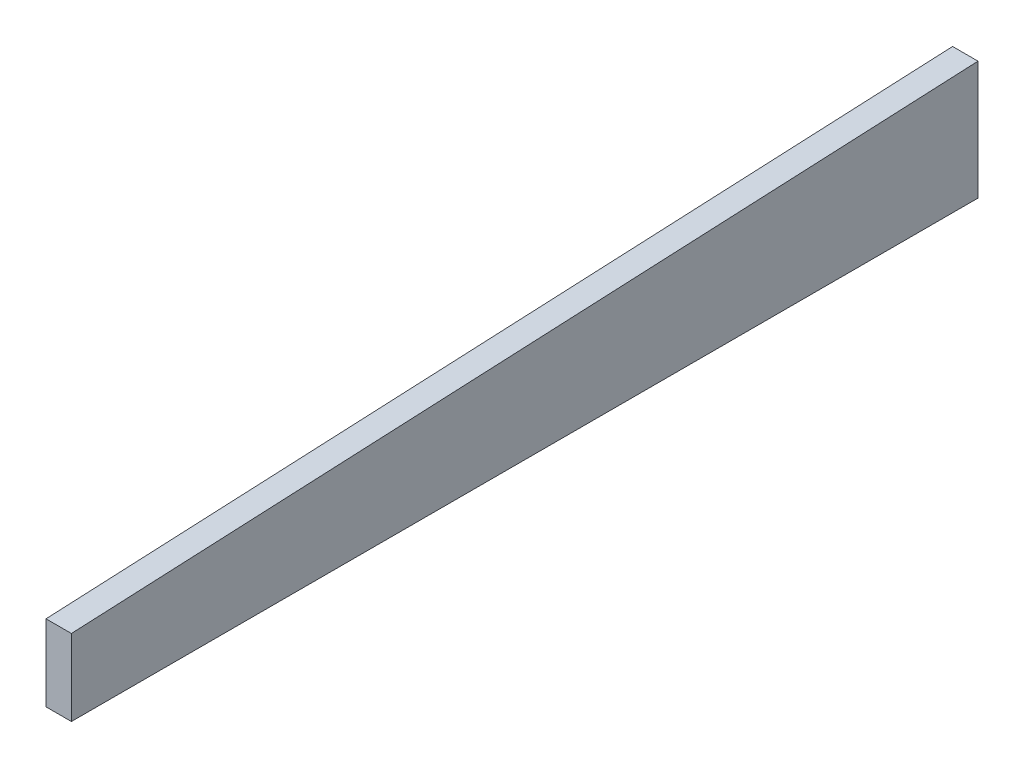
ISO-10303-21;
HEADER;
FILE_DESCRIPTION(('STEP AP214'),'2;1');
FILE_NAME('part.step','',(''),(''),'','','');
FILE_SCHEMA(('AUTOMOTIVE_DESIGN { 1 0 10303 214 1 1 1 1 }'));
ENDSEC;
DATA;
#1=APPLICATION_CONTEXT('core data for automotive mechanical design processes');
#2=APPLICATION_PROTOCOL_DEFINITION('international standard','automotive_design',2000,#1);
#3=PRODUCT_CONTEXT('',#1,'mechanical');
#4=PRODUCT('Part','Part','',(#3));
#5=PRODUCT_RELATED_PRODUCT_CATEGORY('part','',(#4));
#6=PRODUCT_DEFINITION_FORMATION('','',#4);
#7=PRODUCT_DEFINITION_CONTEXT('part definition',#1,'design');
#8=PRODUCT_DEFINITION('design','',#6,#7);
#9=PRODUCT_DEFINITION_SHAPE('','',#8);
#10=(LENGTH_UNIT() NAMED_UNIT(*) SI_UNIT(.MILLI.,.METRE.));
#11=(NAMED_UNIT(*) PLANE_ANGLE_UNIT() SI_UNIT($,.RADIAN.));
#12=(NAMED_UNIT(*) SI_UNIT($,.STERADIAN.) SOLID_ANGLE_UNIT());
#13=UNCERTAINTY_MEASURE_WITH_UNIT(LENGTH_MEASURE(1.E-05),#10,'distance_accuracy_value','');
#14=(GEOMETRIC_REPRESENTATION_CONTEXT(3) GLOBAL_UNCERTAINTY_ASSIGNED_CONTEXT((#13)) GLOBAL_UNIT_ASSIGNED_CONTEXT((#10,
#11,#12)) REPRESENTATION_CONTEXT('',''));
#15=CARTESIAN_POINT('',(0.,0.,0.));
#16=DIRECTION('',(0.,0.,1.));
#17=DIRECTION('',(1.,0.,0.));
#18=AXIS2_PLACEMENT_3D('',#15,#16,#17);
#19=CARTESIAN_POINT('',(19.05,29.6363903064503,66.3484275834207));
#20=DIRECTION('',(0.,0.,-1.));
#21=DIRECTION('',(-1.,0.,0.));
#22=AXIS2_PLACEMENT_3D('',#19,#20,#21);
#23=PLANE('',#22);
#24=DIRECTION('',(0.,-1.,0.));
#25=VECTOR('',#24,1.);
#26=CARTESIAN_POINT('',(0.,29.6363903064503,66.3484275834207));
#27=LINE('',#26,#25);
#28=CARTESIAN_POINT('',(0.,29.6363903064503,66.3484275834207));
#29=VERTEX_POINT('',#28);
#30=CARTESIAN_POINT('',(0.,-27.5136096935497,66.3484275834207));
#31=VERTEX_POINT('',#30);
#32=EDGE_CURVE('E94',#29,#31,#27,.T.);
#33=ORIENTED_EDGE('',*,*,#32,.T.);
#34=DIRECTION('',(-1.,0.,0.));
#35=VECTOR('',#34,1.);
#36=CARTESIAN_POINT('',(19.05,-27.5136096935497,66.3484275834207));
#37=LINE('',#36,#35);
#38=CARTESIAN_POINT('',(19.05,-27.5136096935497,66.3484275834207));
#39=VERTEX_POINT('',#38);
#40=EDGE_CURVE('E11',#39,#31,#37,.T.);
#41=ORIENTED_EDGE('',*,*,#40,.F.);
#42=DIRECTION('',(0.,-1.,0.));
#43=VECTOR('',#42,1.);
#44=CARTESIAN_POINT('',(19.05,29.6363903064503,66.3484275834207));
#45=LINE('',#44,#43);
#46=CARTESIAN_POINT('',(19.05,29.6363903064503,66.3484275834207));
#47=VERTEX_POINT('',#46);
#48=EDGE_CURVE('E82',#47,#39,#45,.T.);
#49=ORIENTED_EDGE('',*,*,#48,.F.);
#50=DIRECTION('',(-1.,0.,0.));
#51=VECTOR('',#50,1.);
#52=CARTESIAN_POINT('',(19.05,29.6363903064503,66.3484275834207));
#53=LINE('',#52,#51);
#54=EDGE_CURVE('E90',#47,#29,#53,.T.);
#55=ORIENTED_EDGE('',*,*,#54,.T.);
#56=EDGE_LOOP('',(#33,#41,#49,#55));
#57=FACE_BOUND('',#56,.T.);
#58=ADVANCED_FACE('F31',(#57),#23,.F.);
#59=CARTESIAN_POINT('',(19.05,-27.5136096935497,66.3484275834207));
#60=DIRECTION('',(0.,1.,0.));
#61=DIRECTION('',(0.,0.,1.));
#62=AXIS2_PLACEMENT_3D('',#59,#60,#61);
#63=PLANE('',#62);
#64=DIRECTION('',(0.,0.,-1.));
#65=VECTOR('',#64,1.);
#66=CARTESIAN_POINT('',(0.,-27.5136096935497,66.3484275834207));
#67=LINE('',#66,#65);
#68=CARTESIAN_POINT('',(0.,-27.5136096935497,-613.101572416579));
#69=VERTEX_POINT('',#68);
#70=EDGE_CURVE('E86',#31,#69,#67,.T.);
#71=ORIENTED_EDGE('',*,*,#70,.T.);
#72=DIRECTION('',(-1.,0.,0.));
#73=VECTOR('',#72,1.);
#74=CARTESIAN_POINT('',(19.05,-27.5136096935497,-613.101572416579));
#75=LINE('',#74,#73);
#76=CARTESIAN_POINT('',(19.05,-27.5136096935497,-613.101572416579));
#77=VERTEX_POINT('',#76);
#78=EDGE_CURVE('E39',#77,#69,#75,.T.);
#79=ORIENTED_EDGE('',*,*,#78,.F.);
#80=DIRECTION('',(0.,0.,-1.));
#81=VECTOR('',#80,1.);
#82=CARTESIAN_POINT('',(19.05,-27.5136096935497,66.3484275834207));
#83=LINE('',#82,#81);
#84=EDGE_CURVE('E77',#39,#77,#83,.T.);
#85=ORIENTED_EDGE('',*,*,#84,.F.);
#86=ORIENTED_EDGE('',*,*,#40,.T.);
#87=EDGE_LOOP('',(#71,#79,#85,#86));
#88=FACE_BOUND('',#87,.T.);
#89=ADVANCED_FACE('F85',(#88),#63,.F.);
#90=CARTESIAN_POINT('',(19.05,61.3863903064503,-613.101572416579));
#91=DIRECTION('',(0.,0.,1.));
#92=DIRECTION('',(1.,0.,0.));
#93=AXIS2_PLACEMENT_3D('',#90,#91,#92);
#94=PLANE('',#93);
#95=DIRECTION('',(0.,1.,0.));
#96=VECTOR('',#95,1.);
#97=CARTESIAN_POINT('',(0.,61.3863903064503,-613.101572416579));
#98=LINE('',#97,#96);
#99=CARTESIAN_POINT('',(0.,61.3863903064503,-613.101572416579));
#100=VERTEX_POINT('',#99);
#101=EDGE_CURVE('E64',#69,#100,#98,.T.);
#102=ORIENTED_EDGE('',*,*,#101,.T.);
#103=DIRECTION('',(-1.,0.,0.));
#104=VECTOR('',#103,1.);
#105=CARTESIAN_POINT('',(19.05,61.3863903064503,-613.101572416579));
#106=LINE('',#105,#104);
#107=CARTESIAN_POINT('',(19.05,61.3863903064503,-613.101572416579));
#108=VERTEX_POINT('',#107);
#109=EDGE_CURVE('E87',#108,#100,#106,.T.);
#110=ORIENTED_EDGE('',*,*,#109,.F.);
#111=DIRECTION('',(0.,1.,0.));
#112=VECTOR('',#111,1.);
#113=CARTESIAN_POINT('',(19.05,61.3863903064503,-613.101572416579));
#114=LINE('',#113,#112);
#115=EDGE_CURVE('E80',#77,#108,#114,.T.);
#116=ORIENTED_EDGE('',*,*,#115,.F.);
#117=ORIENTED_EDGE('',*,*,#78,.T.);
#118=EDGE_LOOP('',(#102,#110,#116,#117));
#119=FACE_BOUND('',#118,.T.);
#120=ADVANCED_FACE('F88',(#119),#94,.F.);
#121=CARTESIAN_POINT('',(19.05,29.6363903064503,66.3484275834207));
#122=DIRECTION('',(0.,-0.998909986377892,-0.0466780367466305));
#123=DIRECTION('',(0.,0.0466780367466305,-0.998909986377892));
#124=AXIS2_PLACEMENT_3D('',#121,#122,#123);
#125=PLANE('',#124);
#126=DIRECTION('',(0.,-0.0466780367466305,0.998909986377892));
#127=VECTOR('',#126,1.);
#128=CARTESIAN_POINT('',(0.,29.6363903064503,66.3484275834207));
#129=LINE('',#128,#127);
#130=EDGE_CURVE('E70',#100,#29,#129,.T.);
#131=ORIENTED_EDGE('',*,*,#130,.T.);
#132=ORIENTED_EDGE('',*,*,#54,.F.);
#133=DIRECTION('',(0.,-0.0466780367466305,0.998909986377892));
#134=VECTOR('',#133,1.);
#135=CARTESIAN_POINT('',(19.05,29.6363903064503,66.3484275834207));
#136=LINE('',#135,#134);
#137=EDGE_CURVE('E47',#108,#47,#136,.T.);
#138=ORIENTED_EDGE('',*,*,#137,.F.);
#139=ORIENTED_EDGE('',*,*,#109,.T.);
#140=EDGE_LOOP('',(#131,#132,#138,#139));
#141=FACE_BOUND('',#140,.T.);
#142=ADVANCED_FACE('F101',(#141),#125,.F.);
#143=CARTESIAN_POINT('',(19.05,-27.5136096935497,66.3484275834207));
#144=DIRECTION('',(1.,0.,0.));
#145=DIRECTION('',(0.,0.,-1.));
#146=AXIS2_PLACEMENT_3D('',#143,#144,#145);
#147=PLANE('',#146);
#148=ORIENTED_EDGE('',*,*,#48,.T.);
#149=ORIENTED_EDGE('',*,*,#84,.T.);
#150=ORIENTED_EDGE('',*,*,#115,.T.);
#151=ORIENTED_EDGE('',*,*,#137,.T.);
#152=EDGE_LOOP('',(#148,#149,#150,#151));
#153=FACE_BOUND('',#152,.T.);
#154=ADVANCED_FACE('F78',(#153),#147,.T.);
#155=CARTESIAN_POINT('',(0.,-27.5136096935497,66.3484275834207));
#156=DIRECTION('',(1.,0.,0.));
#157=DIRECTION('',(0.,0.,-1.));
#158=AXIS2_PLACEMENT_3D('',#155,#156,#157);
#159=PLANE('',#158);
#160=ORIENTED_EDGE('',*,*,#32,.F.);
#161=ORIENTED_EDGE('',*,*,#130,.F.);
#162=ORIENTED_EDGE('',*,*,#101,.F.);
#163=ORIENTED_EDGE('',*,*,#70,.F.);
#164=EDGE_LOOP('',(#160,#161,#162,#163));
#165=FACE_BOUND('',#164,.T.);
#166=ADVANCED_FACE('F104',(#165),#159,.F.);
#167=CLOSED_SHELL('',(#58,#89,#120,#142,#154,#166));
#168=MANIFOLD_SOLID_BREP('B2',#167);
#169=ADVANCED_BREP_SHAPE_REPRESENTATION('',(#18,#168),#14);
#170=SHAPE_DEFINITION_REPRESENTATION(#9,#169);
ENDSEC;
END-ISO-10303-21;
